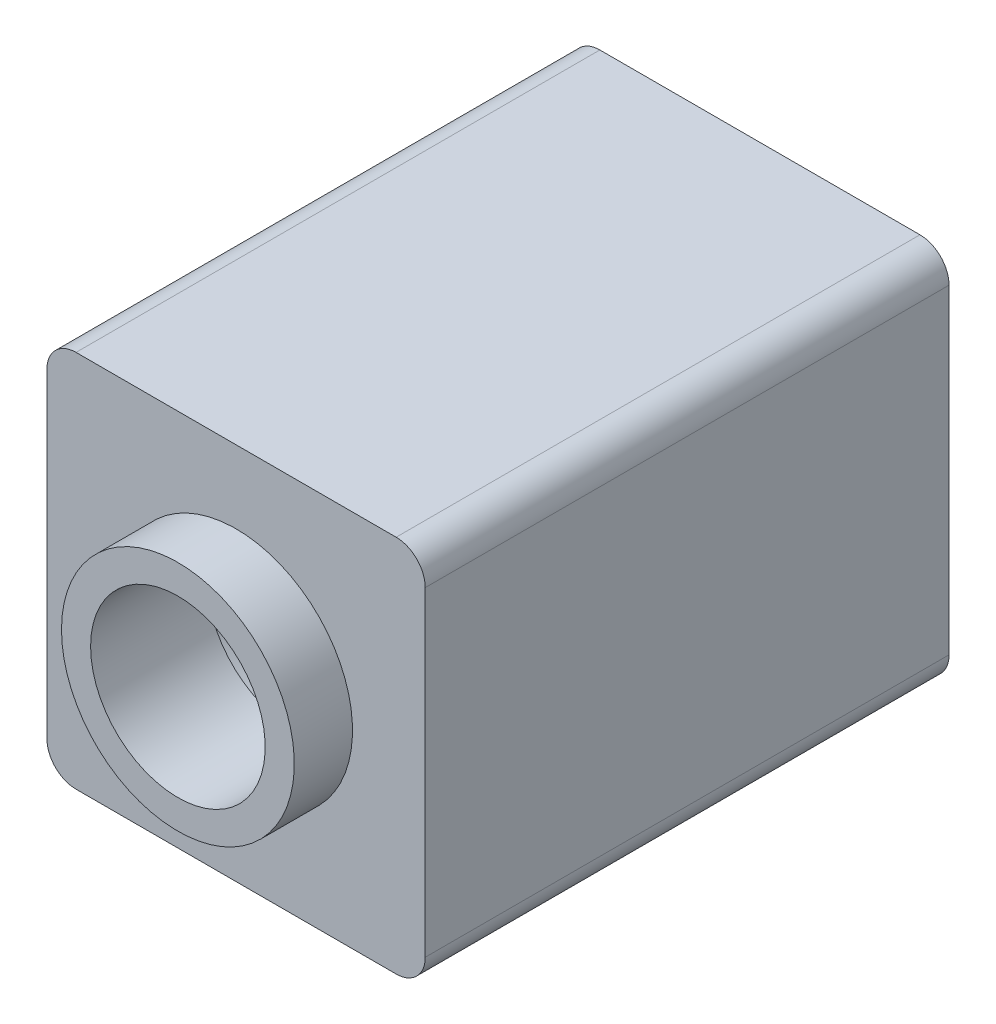
ISO-10303-21;
HEADER;
FILE_DESCRIPTION(('STEP AP214'),'2;1');
FILE_NAME('part.step','',(''),(''),'','','');
FILE_SCHEMA(('AUTOMOTIVE_DESIGN { 1 0 10303 214 1 1 1 1 }'));
ENDSEC;
DATA;
#1=APPLICATION_CONTEXT('core data for automotive mechanical design processes');
#2=APPLICATION_PROTOCOL_DEFINITION('international standard','automotive_design',2000,#1);
#3=PRODUCT_CONTEXT('',#1,'mechanical');
#4=PRODUCT('Part','Part','',(#3));
#5=PRODUCT_RELATED_PRODUCT_CATEGORY('part','',(#4));
#6=PRODUCT_DEFINITION_FORMATION('','',#4);
#7=PRODUCT_DEFINITION_CONTEXT('part definition',#1,'design');
#8=PRODUCT_DEFINITION('design','',#6,#7);
#9=PRODUCT_DEFINITION_SHAPE('','',#8);
#10=(LENGTH_UNIT() NAMED_UNIT(*) SI_UNIT(.MILLI.,.METRE.));
#11=(NAMED_UNIT(*) PLANE_ANGLE_UNIT() SI_UNIT($,.RADIAN.));
#12=(NAMED_UNIT(*) SI_UNIT($,.STERADIAN.) SOLID_ANGLE_UNIT());
#13=UNCERTAINTY_MEASURE_WITH_UNIT(LENGTH_MEASURE(1.E-05),#10,'distance_accuracy_value','');
#14=(GEOMETRIC_REPRESENTATION_CONTEXT(3) GLOBAL_UNCERTAINTY_ASSIGNED_CONTEXT((#13)) GLOBAL_UNIT_ASSIGNED_CONTEXT((#10,
#11,#12)) REPRESENTATION_CONTEXT('',''));
#15=CARTESIAN_POINT('',(0.,0.,0.));
#16=DIRECTION('',(0.,0.,1.));
#17=DIRECTION('',(1.,0.,0.));
#18=AXIS2_PLACEMENT_3D('',#15,#16,#17);
#19=CARTESIAN_POINT('',(3.74045726365418,-31.8283867787374,-67.4654713525207));
#20=DIRECTION('',(0.,0.,1.));
#21=DIRECTION('',(1.,0.,0.));
#22=AXIS2_PLACEMENT_3D('',#19,#20,#21);
#23=CYLINDRICAL_SURFACE('',#22,1.5);
#24=CARTESIAN_POINT('',(3.74045726365418,-31.8283867787374,-57.4654713525207));
#25=DIRECTION('',(0.,0.,-1.));
#26=DIRECTION('',(-1.,0.,0.));
#27=AXIS2_PLACEMENT_3D('',#24,#25,#26);
#28=CIRCLE('',#27,1.5);
#29=CARTESIAN_POINT('',(2.24045726365417,-31.8283867787374,-57.4654713525207));
#30=VERTEX_POINT('',#29);
#31=EDGE_CURVE('E157',#30,#30,#28,.T.);
#32=ORIENTED_EDGE('',*,*,#31,.F.);
#33=EDGE_LOOP('',(#32));
#34=FACE_BOUND('',#33,.T.);
#35=CARTESIAN_POINT('',(3.74045726365418,-31.8283867787374,-59.4654713525207));
#36=DIRECTION('',(0.,0.,-1.));
#37=DIRECTION('',(-1.,0.,0.));
#38=AXIS2_PLACEMENT_3D('',#35,#36,#37);
#39=CIRCLE('',#38,1.5);
#40=CARTESIAN_POINT('',(2.24045726365417,-31.8283867787374,-59.4654713525207));
#41=VERTEX_POINT('',#40);
#42=EDGE_CURVE('E37',#41,#41,#39,.T.);
#43=ORIENTED_EDGE('',*,*,#42,.T.);
#44=EDGE_LOOP('',(#43));
#45=FACE_BOUND('',#44,.T.);
#46=ADVANCED_FACE('F33',(#34,#45),#23,.F.);
#47=CARTESIAN_POINT('',(0.990457263654173,-34.5783867787374,-57.4654713525207));
#48=DIRECTION('',(0.,0.,1.));
#49=DIRECTION('',(1.,0.,0.));
#50=AXIS2_PLACEMENT_3D('',#47,#48,#49);
#51=PLANE('',#50);
#52=ORIENTED_EDGE('',*,*,#31,.T.);
#53=EDGE_LOOP('',(#52));
#54=FACE_BOUND('',#53,.T.);
#55=CARTESIAN_POINT('',(3.74045726365418,-31.8283867787374,-57.4654713525207));
#56=DIRECTION('',(0.,0.,-1.));
#57=DIRECTION('',(-1.,0.,0.));
#58=AXIS2_PLACEMENT_3D('',#55,#56,#57);
#59=CIRCLE('',#58,2.);
#60=CARTESIAN_POINT('',(1.74045726365418,-31.8283867787374,-57.4654713525207));
#61=VERTEX_POINT('',#60);
#62=EDGE_CURVE('E183',#61,#61,#59,.T.);
#63=ORIENTED_EDGE('',*,*,#62,.F.);
#64=EDGE_LOOP('',(#63));
#65=FACE_BOUND('',#64,.T.);
#66=ADVANCED_FACE('F210',(#54,#65),#51,.T.);
#67=CARTESIAN_POINT('',(0.990457263654173,-34.5783867787374,-67.4654713525207));
#68=DIRECTION('',(0.,0.,1.));
#69=DIRECTION('',(1.,0.,0.));
#70=AXIS2_PLACEMENT_3D('',#67,#68,#69);
#71=PLANE('',#70);
#72=CARTESIAN_POINT('',(3.74045726365417,-31.8283867787374,-67.4654713525207));
#73=DIRECTION('',(0.,0.,-1.));
#74=DIRECTION('',(-1.,0.,0.));
#75=AXIS2_PLACEMENT_3D('',#72,#73,#74);
#76=CIRCLE('',#75,2.4);
#77=CARTESIAN_POINT('',(1.34045726365417,-31.8283867787374,-67.4654713525207));
#78=VERTEX_POINT('',#77);
#79=EDGE_CURVE('E188',#78,#78,#76,.T.);
#80=ORIENTED_EDGE('',*,*,#79,.F.);
#81=EDGE_LOOP('',(#80));
#82=FACE_BOUND('',#81,.T.);
#83=CARTESIAN_POINT('',(0.990457263654173,-34.5783867787374,-67.4654713525207));
#84=DIRECTION('',(0.,0.,-1.));
#85=DIRECTION('',(1.,0.,0.));
#86=AXIS2_PLACEMENT_3D('',#83,#84,#85);
#87=CIRCLE('',#86,0.5);
#88=CARTESIAN_POINT('',(0.990457263654173,-35.0783867787374,-67.4654713525207));
#89=VERTEX_POINT('',#88);
#90=CARTESIAN_POINT('',(0.490457263654173,-34.5783867787374,-67.4654713525207));
#91=VERTEX_POINT('',#90);
#92=EDGE_CURVE('E160',#89,#91,#87,.T.);
#93=ORIENTED_EDGE('',*,*,#92,.T.);
#94=DIRECTION('',(0.,1.,0.));
#95=VECTOR('',#94,1.);
#96=CARTESIAN_POINT('',(0.490457263654173,-34.5783867787374,-67.4654713525207));
#97=LINE('',#96,#95);
#98=CARTESIAN_POINT('',(0.490457263654173,-29.0783867787374,-67.4654713525207));
#99=VERTEX_POINT('',#98);
#100=EDGE_CURVE('E146',#91,#99,#97,.T.);
#101=ORIENTED_EDGE('',*,*,#100,.T.);
#102=CARTESIAN_POINT('',(0.990457263654173,-29.0783867787374,-67.4654713525207));
#103=DIRECTION('',(0.,0.,-1.));
#104=DIRECTION('',(-1.,0.,0.));
#105=AXIS2_PLACEMENT_3D('',#102,#103,#104);
#106=CIRCLE('',#105,0.5);
#107=CARTESIAN_POINT('',(0.990457263654173,-28.5783867787374,-67.4654713525207));
#108=VERTEX_POINT('',#107);
#109=EDGE_CURVE('E142',#99,#108,#106,.T.);
#110=ORIENTED_EDGE('',*,*,#109,.T.);
#111=DIRECTION('',(1.,0.,0.));
#112=VECTOR('',#111,1.);
#113=CARTESIAN_POINT('',(6.49045726365417,-28.5783867787374,-67.4654713525207));
#114=LINE('',#113,#112);
#115=CARTESIAN_POINT('',(6.49045726365417,-28.5783867787374,-67.4654713525207));
#116=VERTEX_POINT('',#115);
#117=EDGE_CURVE('E164',#108,#116,#114,.T.);
#118=ORIENTED_EDGE('',*,*,#117,.T.);
#119=CARTESIAN_POINT('',(6.49045726365417,-29.0783867787374,-67.4654713525207));
#120=DIRECTION('',(0.,0.,-1.));
#121=DIRECTION('',(1.,0.,0.));
#122=AXIS2_PLACEMENT_3D('',#119,#120,#121);
#123=CIRCLE('',#122,0.500000000000001);
#124=CARTESIAN_POINT('',(6.99045726365417,-29.0783867787374,-67.4654713525207));
#125=VERTEX_POINT('',#124);
#126=EDGE_CURVE('E166',#116,#125,#123,.T.);
#127=ORIENTED_EDGE('',*,*,#126,.T.);
#128=DIRECTION('',(0.,-1.,0.));
#129=VECTOR('',#128,1.);
#130=CARTESIAN_POINT('',(6.99045726365417,-34.5783867787374,-67.4654713525207));
#131=LINE('',#130,#129);
#132=CARTESIAN_POINT('',(6.99045726365417,-34.5783867787374,-67.4654713525207));
#133=VERTEX_POINT('',#132);
#134=EDGE_CURVE('E123',#125,#133,#131,.T.);
#135=ORIENTED_EDGE('',*,*,#134,.T.);
#136=CARTESIAN_POINT('',(6.49045726365417,-34.5783867787374,-67.4654713525207));
#137=DIRECTION('',(0.,0.,-1.));
#138=DIRECTION('',(-1.,0.,0.));
#139=AXIS2_PLACEMENT_3D('',#136,#137,#138);
#140=CIRCLE('',#139,0.5);
#141=CARTESIAN_POINT('',(6.49045726365417,-35.0783867787374,-67.4654713525207));
#142=VERTEX_POINT('',#141);
#143=EDGE_CURVE('E169',#133,#142,#140,.T.);
#144=ORIENTED_EDGE('',*,*,#143,.T.);
#145=DIRECTION('',(-1.,0.,0.));
#146=VECTOR('',#145,1.);
#147=CARTESIAN_POINT('',(6.49045726365417,-35.0783867787374,-67.4654713525207));
#148=LINE('',#147,#146);
#149=EDGE_CURVE('E57',#142,#89,#148,.T.);
#150=ORIENTED_EDGE('',*,*,#149,.T.);
#151=EDGE_LOOP('',(#93,#101,#110,#118,#127,#135,#144,#150));
#152=FACE_BOUND('',#151,.T.);
#153=ADVANCED_FACE('F216',(#82,#152),#71,.F.);
#154=CARTESIAN_POINT('',(0.990457263654173,-34.5783867787374,-67.4654713525207));
#155=DIRECTION('',(0.,0.,1.));
#156=DIRECTION('',(1.,0.,0.));
#157=AXIS2_PLACEMENT_3D('',#154,#155,#156);
#158=CYLINDRICAL_SURFACE('',#157,0.5);
#159=DIRECTION('',(0.,0.,1.));
#160=VECTOR('',#159,1.);
#161=CARTESIAN_POINT('',(0.990457263654173,-35.0783867787374,-67.4654713525207));
#162=LINE('',#161,#160);
#163=CARTESIAN_POINT('',(0.990457263654173,-35.0783867787374,-58.4654713525207));
#164=VERTEX_POINT('',#163);
#165=EDGE_CURVE('E172',#89,#164,#162,.T.);
#166=ORIENTED_EDGE('',*,*,#165,.T.);
#167=CARTESIAN_POINT('',(0.990457263654173,-34.5783867787374,-58.4654713525207));
#168=DIRECTION('',(0.,0.,-1.));
#169=DIRECTION('',(-1.,0.,0.));
#170=AXIS2_PLACEMENT_3D('',#167,#168,#169);
#171=CIRCLE('',#170,0.5);
#172=CARTESIAN_POINT('',(0.490457263654173,-34.5783867787374,-58.4654713525207));
#173=VERTEX_POINT('',#172);
#174=EDGE_CURVE('E49',#164,#173,#171,.T.);
#175=ORIENTED_EDGE('',*,*,#174,.T.);
#176=DIRECTION('',(0.,0.,1.));
#177=VECTOR('',#176,1.);
#178=CARTESIAN_POINT('',(0.490457263654173,-34.5783867787374,-67.4654713525207));
#179=LINE('',#178,#177);
#180=EDGE_CURVE('E11',#91,#173,#179,.T.);
#181=ORIENTED_EDGE('',*,*,#180,.F.);
#182=ORIENTED_EDGE('',*,*,#92,.F.);
#183=EDGE_LOOP('',(#166,#175,#181,#182));
#184=FACE_BOUND('',#183,.T.);
#185=ADVANCED_FACE('F35',(#184),#158,.T.);
#186=CARTESIAN_POINT('',(0.490457263654173,-34.5783867787374,-67.4654713525207));
#187=DIRECTION('',(1.,0.,0.));
#188=DIRECTION('',(0.,0.,-1.));
#189=AXIS2_PLACEMENT_3D('',#186,#187,#188);
#190=PLANE('',#189);
#191=ORIENTED_EDGE('',*,*,#180,.T.);
#192=DIRECTION('',(0.,1.,0.));
#193=VECTOR('',#192,1.);
#194=CARTESIAN_POINT('',(0.490457263654173,-34.5783867787374,-58.4654713525207));
#195=LINE('',#194,#193);
#196=CARTESIAN_POINT('',(0.490457263654173,-29.0783867787374,-58.4654713525207));
#197=VERTEX_POINT('',#196);
#198=EDGE_CURVE('E147',#173,#197,#195,.T.);
#199=ORIENTED_EDGE('',*,*,#198,.T.);
#200=DIRECTION('',(0.,0.,1.));
#201=VECTOR('',#200,1.);
#202=CARTESIAN_POINT('',(0.490457263654173,-29.0783867787374,-67.4654713525207));
#203=LINE('',#202,#201);
#204=EDGE_CURVE('E42',#99,#197,#203,.T.);
#205=ORIENTED_EDGE('',*,*,#204,.F.);
#206=ORIENTED_EDGE('',*,*,#100,.F.);
#207=EDGE_LOOP('',(#191,#199,#205,#206));
#208=FACE_BOUND('',#207,.T.);
#209=ADVANCED_FACE('F145',(#208),#190,.F.);
#210=CARTESIAN_POINT('',(0.990457263654173,-29.0783867787374,-67.4654713525207));
#211=DIRECTION('',(0.,0.,1.));
#212=DIRECTION('',(1.,0.,0.));
#213=AXIS2_PLACEMENT_3D('',#210,#211,#212);
#214=CYLINDRICAL_SURFACE('',#213,0.5);
#215=ORIENTED_EDGE('',*,*,#204,.T.);
#216=CARTESIAN_POINT('',(0.990457263654173,-29.0783867787374,-58.4654713525207));
#217=DIRECTION('',(0.,0.,-1.));
#218=DIRECTION('',(-1.,0.,0.));
#219=AXIS2_PLACEMENT_3D('',#216,#217,#218);
#220=CIRCLE('',#219,0.5);
#221=CARTESIAN_POINT('',(0.990457263654173,-28.5783867787374,-58.4654713525207));
#222=VERTEX_POINT('',#221);
#223=EDGE_CURVE('E141',#197,#222,#220,.T.);
#224=ORIENTED_EDGE('',*,*,#223,.T.);
#225=DIRECTION('',(0.,0.,1.));
#226=VECTOR('',#225,1.);
#227=CARTESIAN_POINT('',(0.990457263654173,-28.5783867787374,-67.4654713525207));
#228=LINE('',#227,#226);
#229=EDGE_CURVE('E126',#108,#222,#228,.T.);
#230=ORIENTED_EDGE('',*,*,#229,.F.);
#231=ORIENTED_EDGE('',*,*,#109,.F.);
#232=EDGE_LOOP('',(#215,#224,#230,#231));
#233=FACE_BOUND('',#232,.T.);
#234=ADVANCED_FACE('F139',(#233),#214,.T.);
#235=CARTESIAN_POINT('',(6.49045726365417,-28.5783867787374,-67.4654713525207));
#236=DIRECTION('',(0.,-1.,0.));
#237=DIRECTION('',(0.,0.,-1.));
#238=AXIS2_PLACEMENT_3D('',#235,#236,#237);
#239=PLANE('',#238);
#240=ORIENTED_EDGE('',*,*,#229,.T.);
#241=DIRECTION('',(1.,0.,0.));
#242=VECTOR('',#241,1.);
#243=CARTESIAN_POINT('',(0.990457263654173,-28.5783867787374,-58.4654713525207));
#244=LINE('',#243,#242);
#245=CARTESIAN_POINT('',(6.49045726365417,-28.5783867787374,-58.4654713525207));
#246=VERTEX_POINT('',#245);
#247=EDGE_CURVE('E150',#222,#246,#244,.T.);
#248=ORIENTED_EDGE('',*,*,#247,.T.);
#249=DIRECTION('',(0.,0.,1.));
#250=VECTOR('',#249,1.);
#251=CARTESIAN_POINT('',(6.49045726365417,-28.5783867787374,-67.4654713525207));
#252=LINE('',#251,#250);
#253=EDGE_CURVE('E119',#116,#246,#252,.T.);
#254=ORIENTED_EDGE('',*,*,#253,.F.);
#255=ORIENTED_EDGE('',*,*,#117,.F.);
#256=EDGE_LOOP('',(#240,#248,#254,#255));
#257=FACE_BOUND('',#256,.T.);
#258=ADVANCED_FACE('F234',(#257),#239,.F.);
#259=CARTESIAN_POINT('',(6.49045726365417,-29.0783867787374,-67.4654713525207));
#260=DIRECTION('',(0.,0.,1.));
#261=DIRECTION('',(1.,0.,0.));
#262=AXIS2_PLACEMENT_3D('',#259,#260,#261);
#263=CYLINDRICAL_SURFACE('',#262,0.500000000000001);
#264=ORIENTED_EDGE('',*,*,#253,.T.);
#265=CARTESIAN_POINT('',(6.49045726365417,-29.0783867787374,-58.4654713525207));
#266=DIRECTION('',(0.,0.,-1.));
#267=DIRECTION('',(-1.,0.,0.));
#268=AXIS2_PLACEMENT_3D('',#265,#266,#267);
#269=CIRCLE('',#268,0.5);
#270=CARTESIAN_POINT('',(6.99045726365417,-29.0783867787374,-58.4654713525207));
#271=VERTEX_POINT('',#270);
#272=EDGE_CURVE('E102',#246,#271,#269,.T.);
#273=ORIENTED_EDGE('',*,*,#272,.T.);
#274=DIRECTION('',(0.,0.,1.));
#275=VECTOR('',#274,1.);
#276=CARTESIAN_POINT('',(6.99045726365417,-29.0783867787374,-67.4654713525207));
#277=LINE('',#276,#275);
#278=EDGE_CURVE('E116',#125,#271,#277,.T.);
#279=ORIENTED_EDGE('',*,*,#278,.F.);
#280=ORIENTED_EDGE('',*,*,#126,.F.);
#281=EDGE_LOOP('',(#264,#273,#279,#280));
#282=FACE_BOUND('',#281,.T.);
#283=ADVANCED_FACE('F114',(#282),#263,.T.);
#284=CARTESIAN_POINT('',(6.99045726365417,-34.5783867787374,-67.4654713525207));
#285=DIRECTION('',(-1.,0.,0.));
#286=DIRECTION('',(0.,-1.,0.));
#287=AXIS2_PLACEMENT_3D('',#284,#285,#286);
#288=PLANE('',#287);
#289=ORIENTED_EDGE('',*,*,#278,.T.);
#290=DIRECTION('',(0.,-1.,0.));
#291=VECTOR('',#290,1.);
#292=CARTESIAN_POINT('',(6.99045726365417,-29.0783867787374,-58.4654713525207));
#293=LINE('',#292,#291);
#294=CARTESIAN_POINT('',(6.99045726365417,-34.5783867787374,-58.4654713525207));
#295=VERTEX_POINT('',#294);
#296=EDGE_CURVE('E98',#271,#295,#293,.T.);
#297=ORIENTED_EDGE('',*,*,#296,.T.);
#298=DIRECTION('',(0.,0.,1.));
#299=VECTOR('',#298,1.);
#300=CARTESIAN_POINT('',(6.99045726365417,-34.5783867787374,-67.4654713525207));
#301=LINE('',#300,#299);
#302=EDGE_CURVE('E124',#133,#295,#301,.T.);
#303=ORIENTED_EDGE('',*,*,#302,.F.);
#304=ORIENTED_EDGE('',*,*,#134,.F.);
#305=EDGE_LOOP('',(#289,#297,#303,#304));
#306=FACE_BOUND('',#305,.T.);
#307=ADVANCED_FACE('F122',(#306),#288,.F.);
#308=CARTESIAN_POINT('',(6.49045726365417,-34.5783867787374,-67.4654713525207));
#309=DIRECTION('',(0.,0.,1.));
#310=DIRECTION('',(1.,0.,0.));
#311=AXIS2_PLACEMENT_3D('',#308,#309,#310);
#312=CYLINDRICAL_SURFACE('',#311,0.5);
#313=ORIENTED_EDGE('',*,*,#302,.T.);
#314=CARTESIAN_POINT('',(6.49045726365417,-34.5783867787374,-58.4654713525207));
#315=DIRECTION('',(0.,0.,-1.));
#316=DIRECTION('',(-1.,0.,0.));
#317=AXIS2_PLACEMENT_3D('',#314,#315,#316);
#318=CIRCLE('',#317,0.5);
#319=CARTESIAN_POINT('',(6.49045726365417,-35.0783867787374,-58.4654713525207));
#320=VERTEX_POINT('',#319);
#321=EDGE_CURVE('E105',#295,#320,#318,.T.);
#322=ORIENTED_EDGE('',*,*,#321,.T.);
#323=DIRECTION('',(0.,0.,1.));
#324=VECTOR('',#323,1.);
#325=CARTESIAN_POINT('',(6.49045726365417,-35.0783867787374,-67.4654713525207));
#326=LINE('',#325,#324);
#327=EDGE_CURVE('E128',#142,#320,#326,.T.);
#328=ORIENTED_EDGE('',*,*,#327,.F.);
#329=ORIENTED_EDGE('',*,*,#143,.F.);
#330=EDGE_LOOP('',(#313,#322,#328,#329));
#331=FACE_BOUND('',#330,.T.);
#332=ADVANCED_FACE('F180',(#331),#312,.T.);
#333=CARTESIAN_POINT('',(6.49045726365417,-35.0783867787374,-67.4654713525207));
#334=DIRECTION('',(0.,1.,0.));
#335=DIRECTION('',(0.,0.,1.));
#336=AXIS2_PLACEMENT_3D('',#333,#334,#335);
#337=PLANE('',#336);
#338=ORIENTED_EDGE('',*,*,#327,.T.);
#339=DIRECTION('',(-1.,0.,0.));
#340=VECTOR('',#339,1.);
#341=CARTESIAN_POINT('',(6.49045726365417,-35.0783867787374,-58.4654713525207));
#342=LINE('',#341,#340);
#343=EDGE_CURVE('E152',#320,#164,#342,.T.);
#344=ORIENTED_EDGE('',*,*,#343,.T.);
#345=ORIENTED_EDGE('',*,*,#165,.F.);
#346=ORIENTED_EDGE('',*,*,#149,.F.);
#347=EDGE_LOOP('',(#338,#344,#345,#346));
#348=FACE_BOUND('',#347,.T.);
#349=ADVANCED_FACE('F177',(#348),#337,.F.);
#350=CARTESIAN_POINT('',(6.49045726365417,-29.0783867787374,-58.4654713525207));
#351=DIRECTION('',(0.,0.,-1.));
#352=DIRECTION('',(-1.,0.,0.));
#353=AXIS2_PLACEMENT_3D('',#350,#351,#352);
#354=PLANE('',#353);
#355=ORIENTED_EDGE('',*,*,#272,.F.);
#356=ORIENTED_EDGE('',*,*,#247,.F.);
#357=ORIENTED_EDGE('',*,*,#223,.F.);
#358=ORIENTED_EDGE('',*,*,#198,.F.);
#359=ORIENTED_EDGE('',*,*,#174,.F.);
#360=ORIENTED_EDGE('',*,*,#343,.F.);
#361=ORIENTED_EDGE('',*,*,#321,.F.);
#362=ORIENTED_EDGE('',*,*,#296,.F.);
#363=EDGE_LOOP('',(#355,#356,#357,#358,#359,#360,#361,#362));
#364=FACE_BOUND('',#363,.T.);
#365=CARTESIAN_POINT('',(3.74045726365418,-31.8283867787374,-58.4654713525207));
#366=DIRECTION('',(0.,0.,-1.));
#367=DIRECTION('',(-1.,0.,0.));
#368=AXIS2_PLACEMENT_3D('',#365,#366,#367);
#369=CIRCLE('',#368,2.);
#370=CARTESIAN_POINT('',(1.74045726365418,-31.8283867787374,-58.4654713525207));
#371=VERTEX_POINT('',#370);
#372=EDGE_CURVE('E120',#371,#371,#369,.T.);
#373=ORIENTED_EDGE('',*,*,#372,.T.);
#374=EDGE_LOOP('',(#373));
#375=FACE_BOUND('',#374,.T.);
#376=ADVANCED_FACE('F100',(#364,#375),#354,.F.);
#377=CARTESIAN_POINT('',(3.74045726365418,-31.8283867787374,-58.4654713525207));
#378=DIRECTION('',(0.,0.,1.));
#379=DIRECTION('',(1.,0.,0.));
#380=AXIS2_PLACEMENT_3D('',#377,#378,#379);
#381=CYLINDRICAL_SURFACE('',#380,2.);
#382=ORIENTED_EDGE('',*,*,#372,.F.);
#383=EDGE_LOOP('',(#382));
#384=FACE_BOUND('',#383,.T.);
#385=ORIENTED_EDGE('',*,*,#62,.T.);
#386=EDGE_LOOP('',(#385));
#387=FACE_BOUND('',#386,.T.);
#388=ADVANCED_FACE('F206',(#384,#387),#381,.T.);
#389=CARTESIAN_POINT('',(3.74045726365417,-31.8283867787374,-59.4654713525207));
#390=DIRECTION('',(0.,0.,-1.));
#391=DIRECTION('',(-1.,0.,0.));
#392=AXIS2_PLACEMENT_3D('',#389,#390,#391);
#393=CYLINDRICAL_SURFACE('',#392,2.4);
#394=CARTESIAN_POINT('',(3.74045726365417,-31.8283867787374,-59.4654713525207));
#395=DIRECTION('',(0.,0.,-1.));
#396=DIRECTION('',(-1.,0.,0.));
#397=AXIS2_PLACEMENT_3D('',#394,#395,#396);
#398=CIRCLE('',#397,2.4);
#399=CARTESIAN_POINT('',(1.34045726365417,-31.8283867787374,-59.4654713525207));
#400=VERTEX_POINT('',#399);
#401=EDGE_CURVE('E191',#400,#400,#398,.T.);
#402=ORIENTED_EDGE('',*,*,#401,.F.);
#403=EDGE_LOOP('',(#402));
#404=FACE_BOUND('',#403,.T.);
#405=ORIENTED_EDGE('',*,*,#79,.T.);
#406=EDGE_LOOP('',(#405));
#407=FACE_BOUND('',#406,.T.);
#408=ADVANCED_FACE('F201',(#404,#407),#393,.F.);
#409=CARTESIAN_POINT('',(3.74045726365417,-31.8283867787374,-59.4654713525207));
#410=DIRECTION('',(0.,0.,-1.));
#411=DIRECTION('',(-1.,0.,0.));
#412=AXIS2_PLACEMENT_3D('',#409,#410,#411);
#413=PLANE('',#412);
#414=ORIENTED_EDGE('',*,*,#42,.F.);
#415=EDGE_LOOP('',(#414));
#416=FACE_BOUND('',#415,.T.);
#417=ORIENTED_EDGE('',*,*,#401,.T.);
#418=EDGE_LOOP('',(#417));
#419=FACE_BOUND('',#418,.T.);
#420=ADVANCED_FACE('F199',(#416,#419),#413,.T.);
#421=CLOSED_SHELL('',(#46,#66,#153,#185,#209,#234,#258,#283,#307,#332,#349,#376,#388,#408,#420));
#422=MANIFOLD_SOLID_BREP('B2',#421);
#423=ADVANCED_BREP_SHAPE_REPRESENTATION('',(#18,#422),#14);
#424=SHAPE_DEFINITION_REPRESENTATION(#9,#423);
ENDSEC;
END-ISO-10303-21;
